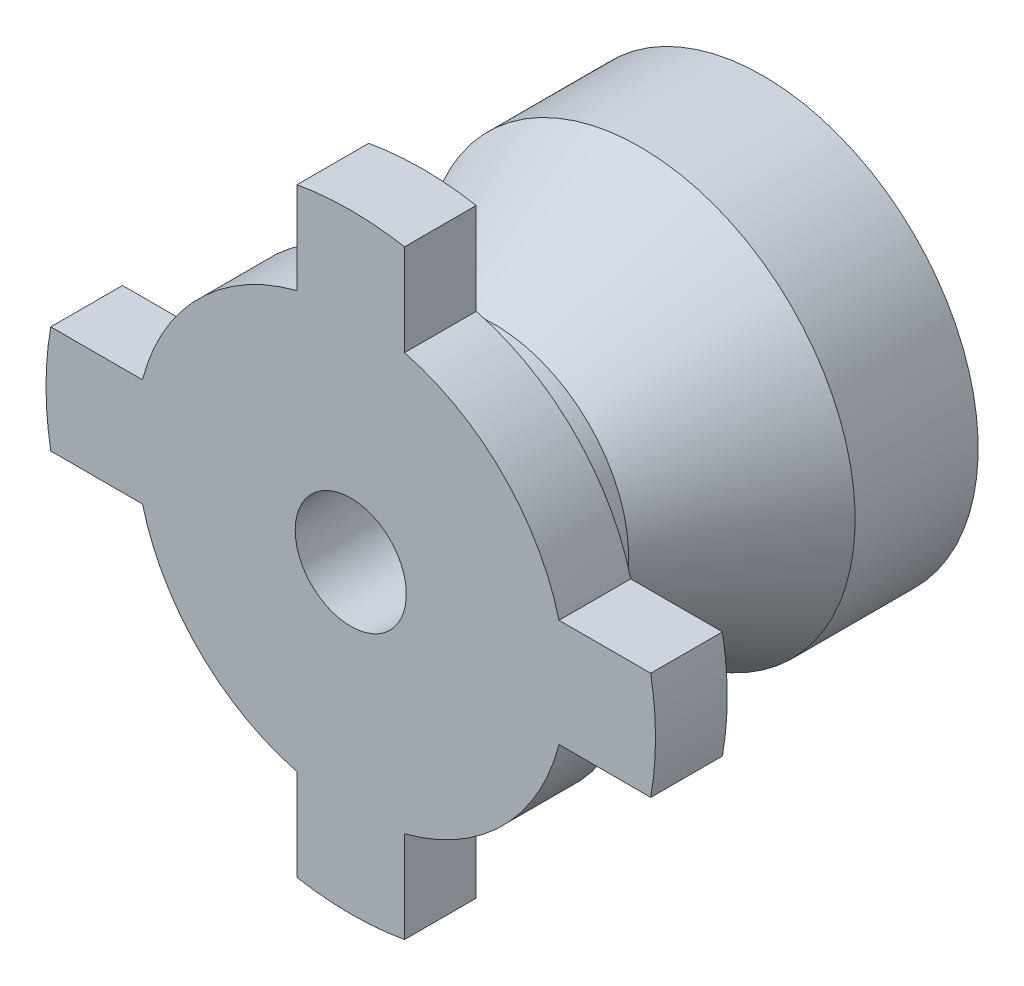
ISO-10303-21;
HEADER;
FILE_DESCRIPTION(('STEP AP214'),'2;1');
FILE_NAME('part.step','',(''),(''),'','','');
FILE_SCHEMA(('AUTOMOTIVE_DESIGN { 1 0 10303 214 1 1 1 1 }'));
ENDSEC;
DATA;
#1=APPLICATION_CONTEXT('core data for automotive mechanical design processes');
#2=APPLICATION_PROTOCOL_DEFINITION('international standard','automotive_design',2000,#1);
#3=PRODUCT_CONTEXT('',#1,'mechanical');
#4=PRODUCT('Part','Part','',(#3));
#5=PRODUCT_RELATED_PRODUCT_CATEGORY('part','',(#4));
#6=PRODUCT_DEFINITION_FORMATION('','',#4);
#7=PRODUCT_DEFINITION_CONTEXT('part definition',#1,'design');
#8=PRODUCT_DEFINITION('design','',#6,#7);
#9=PRODUCT_DEFINITION_SHAPE('','',#8);
#10=(LENGTH_UNIT() NAMED_UNIT(*) SI_UNIT(.MILLI.,.METRE.));
#11=(NAMED_UNIT(*) PLANE_ANGLE_UNIT() SI_UNIT($,.RADIAN.));
#12=(NAMED_UNIT(*) SI_UNIT($,.STERADIAN.) SOLID_ANGLE_UNIT());
#13=UNCERTAINTY_MEASURE_WITH_UNIT(LENGTH_MEASURE(1.E-05),#10,'distance_accuracy_value','');
#14=(GEOMETRIC_REPRESENTATION_CONTEXT(3) GLOBAL_UNCERTAINTY_ASSIGNED_CONTEXT((#13)) GLOBAL_UNIT_ASSIGNED_CONTEXT((#10,
#11,#12)) REPRESENTATION_CONTEXT('',''));
#15=CARTESIAN_POINT('',(0.,0.,0.));
#16=DIRECTION('',(0.,0.,1.));
#17=DIRECTION('',(1.,0.,0.));
#18=AXIS2_PLACEMENT_3D('',#15,#16,#17);
#19=CARTESIAN_POINT('',(0.,0.,-14.2603159562621));
#20=DIRECTION('',(0.,0.,-1.));
#21=DIRECTION('',(-1.,0.,0.));
#22=AXIS2_PLACEMENT_3D('',#19,#20,#21);
#23=CYLINDRICAL_SURFACE('',#22,6.);
#24=DIRECTION('',(0.,0.,1.));
#25=VECTOR('',#24,1.);
#26=CARTESIAN_POINT('',(-5.80947501931113,1.5,-2.));
#27=LINE('',#26,#25);
#28=CARTESIAN_POINT('',(-5.80947501931113,1.5,-2.));
#29=VERTEX_POINT('',#28);
#30=CARTESIAN_POINT('',(-5.80947501931113,1.5,0.));
#31=VERTEX_POINT('',#30);
#32=EDGE_CURVE('E201',#29,#31,#27,.T.);
#33=ORIENTED_EDGE('',*,*,#32,.T.);
#34=CARTESIAN_POINT('',(0.,0.,0.));
#35=DIRECTION('',(0.,0.,-1.));
#36=DIRECTION('',(-1.,0.,0.));
#37=AXIS2_PLACEMENT_3D('',#34,#35,#36);
#38=CIRCLE('',#37,6.);
#39=CARTESIAN_POINT('',(-1.5,5.80947501931113,0.));
#40=VERTEX_POINT('',#39);
#41=EDGE_CURVE('E319',#31,#40,#38,.T.);
#42=ORIENTED_EDGE('',*,*,#41,.T.);
#43=DIRECTION('',(0.,0.,1.));
#44=VECTOR('',#43,1.);
#45=CARTESIAN_POINT('',(-1.5,5.80947501931113,-2.));
#46=LINE('',#45,#44);
#47=CARTESIAN_POINT('',(-1.5,5.80947501931113,-2.));
#48=VERTEX_POINT('',#47);
#49=EDGE_CURVE('E211',#48,#40,#46,.T.);
#50=ORIENTED_EDGE('',*,*,#49,.F.);
#51=CARTESIAN_POINT('',(0.,0.,-2.));
#52=DIRECTION('',(0.,0.,-1.));
#53=DIRECTION('',(-1.,0.,0.));
#54=AXIS2_PLACEMENT_3D('',#51,#52,#53);
#55=CIRCLE('',#54,6.);
#56=EDGE_CURVE('E11',#29,#48,#55,.T.);
#57=ORIENTED_EDGE('',*,*,#56,.F.);
#58=EDGE_LOOP('',(#33,#42,#50,#57));
#59=FACE_BOUND('',#58,.T.);
#60=ADVANCED_FACE('F45',(#59),#23,.T.);
#61=DIRECTION('',(0.,0.,1.));
#62=VECTOR('',#61,1.);
#63=CARTESIAN_POINT('',(1.5,5.80947501931113,-2.));
#64=LINE('',#63,#62);
#65=CARTESIAN_POINT('',(1.5,5.80947501931113,-2.));
#66=VERTEX_POINT('',#65);
#67=CARTESIAN_POINT('',(1.5,5.80947501931113,0.));
#68=VERTEX_POINT('',#67);
#69=EDGE_CURVE('E215',#66,#68,#64,.T.);
#70=ORIENTED_EDGE('',*,*,#69,.T.);
#71=CARTESIAN_POINT('',(5.80947501931113,1.5,0.));
#72=VERTEX_POINT('',#71);
#73=EDGE_CURVE('E323',#68,#72,#38,.T.);
#74=ORIENTED_EDGE('',*,*,#73,.T.);
#75=DIRECTION('',(0.,0.,1.));
#76=VECTOR('',#75,1.);
#77=CARTESIAN_POINT('',(5.80947501931113,1.5,-2.));
#78=LINE('',#77,#76);
#79=CARTESIAN_POINT('',(5.80947501931113,1.5,-2.));
#80=VERTEX_POINT('',#79);
#81=EDGE_CURVE('E249',#80,#72,#78,.T.);
#82=ORIENTED_EDGE('',*,*,#81,.F.);
#83=EDGE_CURVE('E54',#66,#80,#55,.T.);
#84=ORIENTED_EDGE('',*,*,#83,.F.);
#85=EDGE_LOOP('',(#70,#74,#82,#84));
#86=FACE_BOUND('',#85,.T.);
#87=ADVANCED_FACE('F418',(#86),#23,.T.);
#88=DIRECTION('',(0.,0.,1.));
#89=VECTOR('',#88,1.);
#90=CARTESIAN_POINT('',(5.80947501931113,-1.5,-2.));
#91=LINE('',#90,#89);
#92=CARTESIAN_POINT('',(5.80947501931112,-1.5,-2.));
#93=VERTEX_POINT('',#92);
#94=CARTESIAN_POINT('',(5.80947501931113,-1.5,0.));
#95=VERTEX_POINT('',#94);
#96=EDGE_CURVE('E253',#93,#95,#91,.T.);
#97=ORIENTED_EDGE('',*,*,#96,.T.);
#98=CARTESIAN_POINT('',(1.5,-5.80947501931113,0.));
#99=VERTEX_POINT('',#98);
#100=EDGE_CURVE('E389',#95,#99,#38,.T.);
#101=ORIENTED_EDGE('',*,*,#100,.T.);
#102=DIRECTION('',(0.,0.,1.));
#103=VECTOR('',#102,1.);
#104=CARTESIAN_POINT('',(1.5,-5.80947501931113,-2.));
#105=LINE('',#104,#103);
#106=CARTESIAN_POINT('',(1.5,-5.80947501931113,-2.));
#107=VERTEX_POINT('',#106);
#108=EDGE_CURVE('E287',#107,#99,#105,.T.);
#109=ORIENTED_EDGE('',*,*,#108,.F.);
#110=EDGE_CURVE('E364',#93,#107,#55,.T.);
#111=ORIENTED_EDGE('',*,*,#110,.F.);
#112=EDGE_LOOP('',(#97,#101,#109,#111));
#113=FACE_BOUND('',#112,.T.);
#114=ADVANCED_FACE('F388',(#113),#23,.T.);
#115=DIRECTION('',(0.,0.,1.));
#116=VECTOR('',#115,1.);
#117=CARTESIAN_POINT('',(-5.80947501931113,-1.5,-2.));
#118=LINE('',#117,#116);
#119=CARTESIAN_POINT('',(-5.80947501931113,-1.5,-2.));
#120=VERTEX_POINT('',#119);
#121=CARTESIAN_POINT('',(-5.80947501931113,-1.5,0.));
#122=VERTEX_POINT('',#121);
#123=EDGE_CURVE('E62',#120,#122,#118,.T.);
#124=ORIENTED_EDGE('',*,*,#123,.F.);
#125=CARTESIAN_POINT('',(-1.5,-5.80947501931113,-2.));
#126=VERTEX_POINT('',#125);
#127=EDGE_CURVE('E55',#126,#120,#55,.T.);
#128=ORIENTED_EDGE('',*,*,#127,.F.);
#129=DIRECTION('',(0.,0.,1.));
#130=VECTOR('',#129,1.);
#131=CARTESIAN_POINT('',(-1.5,-5.80947501931113,-2.));
#132=LINE('',#131,#130);
#133=CARTESIAN_POINT('',(-1.5,-5.80947501931113,0.));
#134=VERTEX_POINT('',#133);
#135=EDGE_CURVE('E291',#126,#134,#132,.T.);
#136=ORIENTED_EDGE('',*,*,#135,.T.);
#137=EDGE_CURVE('E200',#134,#122,#38,.T.);
#138=ORIENTED_EDGE('',*,*,#137,.T.);
#139=EDGE_LOOP('',(#124,#128,#136,#138));
#140=FACE_BOUND('',#139,.T.);
#141=ADVANCED_FACE('F47',(#140),#23,.T.);
#142=CARTESIAN_POINT('',(-6.,0.,-2.));
#143=DIRECTION('',(0.,0.,-1.));
#144=DIRECTION('',(-1.,0.,0.));
#145=AXIS2_PLACEMENT_3D('',#142,#143,#144);
#146=PLANE('',#145);
#147=ORIENTED_EDGE('',*,*,#56,.T.);
#148=DIRECTION('',(0.,-1.,0.));
#149=VECTOR('',#148,1.);
#150=CARTESIAN_POINT('',(-1.5,8.36660026534076,-2.));
#151=LINE('',#150,#149);
#152=CARTESIAN_POINT('',(-1.5,8.36660026534076,-2.));
#153=VERTEX_POINT('',#152);
#154=EDGE_CURVE('E238',#153,#48,#151,.T.);
#155=ORIENTED_EDGE('',*,*,#154,.F.);
#156=CARTESIAN_POINT('',(0.,0.,-2.));
#157=DIRECTION('',(0.,0.,1.));
#158=DIRECTION('',(1.,0.,0.));
#159=AXIS2_PLACEMENT_3D('',#156,#157,#158);
#160=CIRCLE('',#159,8.5);
#161=CARTESIAN_POINT('',(1.5,8.36660026534076,-2.));
#162=VERTEX_POINT('',#161);
#163=EDGE_CURVE('E228',#162,#153,#160,.T.);
#164=ORIENTED_EDGE('',*,*,#163,.F.);
#165=DIRECTION('',(0.,1.,0.));
#166=VECTOR('',#165,1.);
#167=CARTESIAN_POINT('',(1.5,8.36660026534076,-2.));
#168=LINE('',#167,#166);
#169=EDGE_CURVE('E210',#66,#162,#168,.T.);
#170=ORIENTED_EDGE('',*,*,#169,.F.);
#171=ORIENTED_EDGE('',*,*,#83,.T.);
#172=DIRECTION('',(-1.,0.,0.));
#173=VECTOR('',#172,1.);
#174=CARTESIAN_POINT('',(8.36660026534076,1.5,-2.));
#175=LINE('',#174,#173);
#176=CARTESIAN_POINT('',(8.36660026534076,1.5,-2.));
#177=VERTEX_POINT('',#176);
#178=EDGE_CURVE('E276',#177,#80,#175,.T.);
#179=ORIENTED_EDGE('',*,*,#178,.F.);
#180=CARTESIAN_POINT('',(0.,0.,-2.));
#181=DIRECTION('',(0.,0.,1.));
#182=DIRECTION('',(1.,0.,0.));
#183=AXIS2_PLACEMENT_3D('',#180,#181,#182);
#184=CIRCLE('',#183,8.5);
#185=CARTESIAN_POINT('',(8.36660026534076,-1.5,-2.));
#186=VERTEX_POINT('',#185);
#187=EDGE_CURVE('E266',#186,#177,#184,.T.);
#188=ORIENTED_EDGE('',*,*,#187,.F.);
#189=DIRECTION('',(1.,0.,0.));
#190=VECTOR('',#189,1.);
#191=CARTESIAN_POINT('',(8.36660026534076,-1.5,-2.));
#192=LINE('',#191,#190);
#193=EDGE_CURVE('E248',#93,#186,#192,.T.);
#194=ORIENTED_EDGE('',*,*,#193,.F.);
#195=ORIENTED_EDGE('',*,*,#110,.T.);
#196=DIRECTION('',(0.,1.,0.));
#197=VECTOR('',#196,1.);
#198=CARTESIAN_POINT('',(1.5,-8.36660026534076,-2.));
#199=LINE('',#198,#197);
#200=CARTESIAN_POINT('',(1.5,-8.36660026534076,-2.));
#201=VERTEX_POINT('',#200);
#202=EDGE_CURVE('E312',#201,#107,#199,.T.);
#203=ORIENTED_EDGE('',*,*,#202,.F.);
#204=CARTESIAN_POINT('',(0.,0.,-2.));
#205=DIRECTION('',(0.,0.,1.));
#206=DIRECTION('',(1.,0.,0.));
#207=AXIS2_PLACEMENT_3D('',#204,#205,#206);
#208=CIRCLE('',#207,8.5);
#209=CARTESIAN_POINT('',(-1.5,-8.36660026534076,-2.));
#210=VERTEX_POINT('',#209);
#211=EDGE_CURVE('E302',#210,#201,#208,.T.);
#212=ORIENTED_EDGE('',*,*,#211,.F.);
#213=DIRECTION('',(0.,-1.,0.));
#214=VECTOR('',#213,1.);
#215=CARTESIAN_POINT('',(-1.5,-8.36660026534076,-2.));
#216=LINE('',#215,#214);
#217=EDGE_CURVE('E286',#126,#210,#216,.T.);
#218=ORIENTED_EDGE('',*,*,#217,.F.);
#219=ORIENTED_EDGE('',*,*,#127,.T.);
#220=DIRECTION('',(1.,0.,0.));
#221=VECTOR('',#220,1.);
#222=CARTESIAN_POINT('',(-8.36660026534076,-1.5,-2.));
#223=LINE('',#222,#221);
#224=CARTESIAN_POINT('',(-8.36660026534076,-1.5,-2.));
#225=VERTEX_POINT('',#224);
#226=EDGE_CURVE('E161',#225,#120,#223,.T.);
#227=ORIENTED_EDGE('',*,*,#226,.F.);
#228=CARTESIAN_POINT('',(0.,0.,-2.));
#229=DIRECTION('',(0.,0.,1.));
#230=DIRECTION('',(1.,0.,0.));
#231=AXIS2_PLACEMENT_3D('',#228,#229,#230);
#232=CIRCLE('',#231,8.5);
#233=CARTESIAN_POINT('',(-8.36660026534076,1.5,-2.));
#234=VERTEX_POINT('',#233);
#235=EDGE_CURVE('E176',#234,#225,#232,.T.);
#236=ORIENTED_EDGE('',*,*,#235,.F.);
#237=DIRECTION('',(-1.,0.,0.));
#238=VECTOR('',#237,1.);
#239=CARTESIAN_POINT('',(-8.36660026534076,1.5,-2.));
#240=LINE('',#239,#238);
#241=EDGE_CURVE('E169',#29,#234,#240,.T.);
#242=ORIENTED_EDGE('',*,*,#241,.F.);
#243=EDGE_LOOP('',(#147,#155,#164,#170,#171,#179,#188,#194,#195,#203,#212,#218,#219,#227,#236,#242));
#244=FACE_BOUND('',#243,.T.);
#245=CARTESIAN_POINT('',(0.,0.,-2.));
#246=DIRECTION('',(0.,0.,-1.));
#247=DIRECTION('',(-1.,0.,0.));
#248=AXIS2_PLACEMENT_3D('',#245,#246,#247);
#249=CIRCLE('',#248,3.75);
#250=CARTESIAN_POINT('',(-3.75,0.,-2.));
#251=VERTEX_POINT('',#250);
#252=EDGE_CURVE('E358',#251,#251,#249,.T.);
#253=ORIENTED_EDGE('',*,*,#252,.F.);
#254=EDGE_LOOP('',(#253));
#255=FACE_BOUND('',#254,.T.);
#256=ADVANCED_FACE('F173',(#244,#255),#146,.T.);
#257=CARTESIAN_POINT('',(0.,0.,-14.2603159562621));
#258=DIRECTION('',(0.,0.,-1.));
#259=DIRECTION('',(-1.,0.,0.));
#260=AXIS2_PLACEMENT_3D('',#257,#258,#259);
#261=CYLINDRICAL_SURFACE('',#260,3.75);
#262=ORIENTED_EDGE('',*,*,#252,.T.);
#263=EDGE_LOOP('',(#262));
#264=FACE_BOUND('',#263,.T.);
#265=CARTESIAN_POINT('',(0.,0.,-4.));
#266=DIRECTION('',(0.,0.,-1.));
#267=DIRECTION('',(-1.,0.,0.));
#268=AXIS2_PLACEMENT_3D('',#265,#266,#267);
#269=CIRCLE('',#268,3.75);
#270=CARTESIAN_POINT('',(-3.75,0.,-4.));
#271=VERTEX_POINT('',#270);
#272=EDGE_CURVE('E355',#271,#271,#269,.T.);
#273=ORIENTED_EDGE('',*,*,#272,.F.);
#274=EDGE_LOOP('',(#273));
#275=FACE_BOUND('',#274,.T.);
#276=ADVANCED_FACE('F433',(#264,#275),#261,.T.);
#277=CARTESIAN_POINT('',(0.,0.,-8.06724970437732));
#278=DIRECTION('',(0.,0.,-1.));
#279=DIRECTION('',(-1.,0.,0.));
#280=AXIS2_PLACEMENT_3D('',#277,#278,#279);
#281=CONICAL_SURFACE('',#280,6.,0.50529622703933);
#282=ORIENTED_EDGE('',*,*,#272,.T.);
#283=EDGE_LOOP('',(#282));
#284=FACE_BOUND('',#283,.T.);
#285=CARTESIAN_POINT('',(0.,0.,-8.06724970437732));
#286=DIRECTION('',(0.,0.,-1.));
#287=DIRECTION('',(-1.,0.,0.));
#288=AXIS2_PLACEMENT_3D('',#285,#286,#287);
#289=CIRCLE('',#288,6.);
#290=CARTESIAN_POINT('',(-6.,0.,-8.06724970437732));
#291=VERTEX_POINT('',#290);
#292=EDGE_CURVE('E351',#291,#291,#289,.T.);
#293=ORIENTED_EDGE('',*,*,#292,.F.);
#294=EDGE_LOOP('',(#293));
#295=FACE_BOUND('',#294,.T.);
#296=ADVANCED_FACE('F438',(#284,#295),#281,.T.);
#297=CARTESIAN_POINT('',(0.,0.,-14.2603159562621));
#298=DIRECTION('',(0.,0.,-1.));
#299=DIRECTION('',(-1.,0.,0.));
#300=AXIS2_PLACEMENT_3D('',#297,#298,#299);
#301=CYLINDRICAL_SURFACE('',#300,6.);
#302=ORIENTED_EDGE('',*,*,#292,.T.);
#303=EDGE_LOOP('',(#302));
#304=FACE_BOUND('',#303,.T.);
#305=CARTESIAN_POINT('',(0.,0.,-11.5));
#306=DIRECTION('',(0.,0.,-1.));
#307=DIRECTION('',(-1.,0.,0.));
#308=AXIS2_PLACEMENT_3D('',#305,#306,#307);
#309=CIRCLE('',#308,6.);
#310=CARTESIAN_POINT('',(-6.,0.,-11.5));
#311=VERTEX_POINT('',#310);
#312=EDGE_CURVE('E347',#311,#311,#309,.T.);
#313=ORIENTED_EDGE('',*,*,#312,.F.);
#314=EDGE_LOOP('',(#313));
#315=FACE_BOUND('',#314,.T.);
#316=ADVANCED_FACE('F443',(#304,#315),#301,.T.);
#317=CARTESIAN_POINT('',(-6.,0.,-11.5));
#318=DIRECTION('',(0.,0.,-1.));
#319=DIRECTION('',(-1.,0.,0.));
#320=AXIS2_PLACEMENT_3D('',#317,#318,#319);
#321=PLANE('',#320);
#322=ORIENTED_EDGE('',*,*,#312,.T.);
#323=EDGE_LOOP('',(#322));
#324=FACE_BOUND('',#323,.T.);
#325=CARTESIAN_POINT('',(0.,0.,-11.5));
#326=DIRECTION('',(0.,0.,-1.));
#327=DIRECTION('',(-1.,0.,0.));
#328=AXIS2_PLACEMENT_3D('',#325,#326,#327);
#329=CIRCLE('',#328,5.);
#330=CARTESIAN_POINT('',(-5.,0.,-11.5));
#331=VERTEX_POINT('',#330);
#332=EDGE_CURVE('E343',#331,#331,#329,.T.);
#333=ORIENTED_EDGE('',*,*,#332,.F.);
#334=EDGE_LOOP('',(#333));
#335=FACE_BOUND('',#334,.T.);
#336=ADVANCED_FACE('F447',(#324,#335),#321,.T.);
#337=CARTESIAN_POINT('',(0.,0.,-14.2603159562621));
#338=DIRECTION('',(0.,0.,-1.));
#339=DIRECTION('',(-1.,0.,0.));
#340=AXIS2_PLACEMENT_3D('',#337,#338,#339);
#341=CYLINDRICAL_SURFACE('',#340,5.);
#342=ORIENTED_EDGE('',*,*,#332,.T.);
#343=EDGE_LOOP('',(#342));
#344=FACE_BOUND('',#343,.T.);
#345=CARTESIAN_POINT('',(0.,0.,-9.));
#346=DIRECTION('',(0.,0.,-1.));
#347=DIRECTION('',(-1.,0.,0.));
#348=AXIS2_PLACEMENT_3D('',#345,#346,#347);
#349=CIRCLE('',#348,5.);
#350=CARTESIAN_POINT('',(-5.,0.,-9.));
#351=VERTEX_POINT('',#350);
#352=EDGE_CURVE('E339',#351,#351,#349,.T.);
#353=ORIENTED_EDGE('',*,*,#352,.F.);
#354=EDGE_LOOP('',(#353));
#355=FACE_BOUND('',#354,.T.);
#356=ADVANCED_FACE('F451',(#344,#355),#341,.F.);
#357=CARTESIAN_POINT('',(-5.,0.,-9.));
#358=DIRECTION('',(0.,0.,-1.));
#359=DIRECTION('',(-1.,0.,0.));
#360=AXIS2_PLACEMENT_3D('',#357,#358,#359);
#361=PLANE('',#360);
#362=ORIENTED_EDGE('',*,*,#352,.T.);
#363=EDGE_LOOP('',(#362));
#364=FACE_BOUND('',#363,.T.);
#365=CARTESIAN_POINT('',(0.,0.,-9.));
#366=DIRECTION('',(0.,0.,-1.));
#367=DIRECTION('',(-1.,0.,0.));
#368=AXIS2_PLACEMENT_3D('',#365,#366,#367);
#369=CIRCLE('',#368,2.68835962889717);
#370=CARTESIAN_POINT('',(-2.68835962889717,0.,-9.));
#371=VERTEX_POINT('',#370);
#372=EDGE_CURVE('E335',#371,#371,#369,.T.);
#373=ORIENTED_EDGE('',*,*,#372,.F.);
#374=EDGE_LOOP('',(#373));
#375=FACE_BOUND('',#374,.T.);
#376=ADVANCED_FACE('F455',(#364,#375),#361,.T.);
#377=CARTESIAN_POINT('',(0.,0.,-14.2603159562621));
#378=DIRECTION('',(0.,0.,-1.));
#379=DIRECTION('',(-1.,0.,0.));
#380=AXIS2_PLACEMENT_3D('',#377,#378,#379);
#381=CYLINDRICAL_SURFACE('',#380,2.68835962889717);
#382=ORIENTED_EDGE('',*,*,#372,.T.);
#383=EDGE_LOOP('',(#382));
#384=FACE_BOUND('',#383,.T.);
#385=CARTESIAN_POINT('',(0.,0.,-7.5));
#386=DIRECTION('',(0.,0.,-1.));
#387=DIRECTION('',(-1.,0.,0.));
#388=AXIS2_PLACEMENT_3D('',#385,#386,#387);
#389=CIRCLE('',#388,2.68835962889717);
#390=CARTESIAN_POINT('',(-2.68835962889717,0.,-7.5));
#391=VERTEX_POINT('',#390);
#392=EDGE_CURVE('E331',#391,#391,#389,.T.);
#393=ORIENTED_EDGE('',*,*,#392,.F.);
#394=EDGE_LOOP('',(#393));
#395=FACE_BOUND('',#394,.T.);
#396=ADVANCED_FACE('F459',(#384,#395),#381,.F.);
#397=CARTESIAN_POINT('',(-2.68835962889717,0.,-7.5));
#398=DIRECTION('',(0.,0.,-1.));
#399=DIRECTION('',(-1.,0.,0.));
#400=AXIS2_PLACEMENT_3D('',#397,#398,#399);
#401=PLANE('',#400);
#402=ORIENTED_EDGE('',*,*,#392,.T.);
#403=EDGE_LOOP('',(#402));
#404=FACE_BOUND('',#403,.T.);
#405=CARTESIAN_POINT('',(0.,0.,-7.5));
#406=DIRECTION('',(0.,0.,-1.));
#407=DIRECTION('',(-1.,0.,0.));
#408=AXIS2_PLACEMENT_3D('',#405,#406,#407);
#409=CIRCLE('',#408,1.55);
#410=CARTESIAN_POINT('',(-1.55,0.,-7.5));
#411=VERTEX_POINT('',#410);
#412=EDGE_CURVE('E327',#411,#411,#409,.T.);
#413=ORIENTED_EDGE('',*,*,#412,.F.);
#414=EDGE_LOOP('',(#413));
#415=FACE_BOUND('',#414,.T.);
#416=ADVANCED_FACE('F463',(#404,#415),#401,.T.);
#417=CARTESIAN_POINT('',(0.,0.,-14.2603159562621));
#418=DIRECTION('',(0.,0.,-1.));
#419=DIRECTION('',(-1.,0.,0.));
#420=AXIS2_PLACEMENT_3D('',#417,#418,#419);
#421=CYLINDRICAL_SURFACE('',#420,1.55);
#422=ORIENTED_EDGE('',*,*,#412,.T.);
#423=EDGE_LOOP('',(#422));
#424=FACE_BOUND('',#423,.T.);
#425=CARTESIAN_POINT('',(0.,0.,0.));
#426=DIRECTION('',(0.,0.,-1.));
#427=DIRECTION('',(-1.,0.,0.));
#428=AXIS2_PLACEMENT_3D('',#425,#426,#427);
#429=CIRCLE('',#428,1.55);
#430=CARTESIAN_POINT('',(-1.55,0.,0.));
#431=VERTEX_POINT('',#430);
#432=EDGE_CURVE('E322',#431,#431,#429,.T.);
#433=ORIENTED_EDGE('',*,*,#432,.F.);
#434=EDGE_LOOP('',(#433));
#435=FACE_BOUND('',#434,.T.);
#436=ADVANCED_FACE('F467',(#424,#435),#421,.F.);
#437=CARTESIAN_POINT('',(-1.55,0.,0.));
#438=DIRECTION('',(0.,0.,1.));
#439=DIRECTION('',(1.,0.,0.));
#440=AXIS2_PLACEMENT_3D('',#437,#438,#439);
#441=PLANE('',#440);
#442=ORIENTED_EDGE('',*,*,#432,.T.);
#443=EDGE_LOOP('',(#442));
#444=FACE_BOUND('',#443,.T.);
#445=ORIENTED_EDGE('',*,*,#41,.F.);
#446=DIRECTION('',(-1.,0.,0.));
#447=VECTOR('',#446,1.);
#448=CARTESIAN_POINT('',(-8.36660026534076,1.5,0.));
#449=LINE('',#448,#447);
#450=CARTESIAN_POINT('',(-8.36660026534076,1.5,0.));
#451=VERTEX_POINT('',#450);
#452=EDGE_CURVE('E184',#31,#451,#449,.T.);
#453=ORIENTED_EDGE('',*,*,#452,.T.);
#454=CARTESIAN_POINT('',(0.,0.,0.));
#455=DIRECTION('',(0.,0.,1.));
#456=DIRECTION('',(1.,0.,0.));
#457=AXIS2_PLACEMENT_3D('',#454,#455,#456);
#458=CIRCLE('',#457,8.5);
#459=CARTESIAN_POINT('',(-8.36660026534076,-1.5,0.));
#460=VERTEX_POINT('',#459);
#461=EDGE_CURVE('E192',#451,#460,#458,.T.);
#462=ORIENTED_EDGE('',*,*,#461,.T.);
#463=DIRECTION('',(1.,0.,0.));
#464=VECTOR('',#463,1.);
#465=CARTESIAN_POINT('',(-8.36660026534076,-1.5,0.));
#466=LINE('',#465,#464);
#467=EDGE_CURVE('E163',#460,#122,#466,.T.);
#468=ORIENTED_EDGE('',*,*,#467,.T.);
#469=ORIENTED_EDGE('',*,*,#137,.F.);
#470=DIRECTION('',(0.,-1.,0.));
#471=VECTOR('',#470,1.);
#472=CARTESIAN_POINT('',(-1.5,-8.36660026534076,0.));
#473=LINE('',#472,#471);
#474=CARTESIAN_POINT('',(-1.5,-8.36660026534076,0.));
#475=VERTEX_POINT('',#474);
#476=EDGE_CURVE('E297',#134,#475,#473,.T.);
#477=ORIENTED_EDGE('',*,*,#476,.T.);
#478=CARTESIAN_POINT('',(0.,0.,0.));
#479=DIRECTION('',(0.,0.,1.));
#480=DIRECTION('',(1.,0.,0.));
#481=AXIS2_PLACEMENT_3D('',#478,#479,#480);
#482=CIRCLE('',#481,8.5);
#483=CARTESIAN_POINT('',(1.5,-8.36660026534076,0.));
#484=VERTEX_POINT('',#483);
#485=EDGE_CURVE('E260',#475,#484,#482,.T.);
#486=ORIENTED_EDGE('',*,*,#485,.T.);
#487=DIRECTION('',(0.,1.,0.));
#488=VECTOR('',#487,1.);
#489=CARTESIAN_POINT('',(1.5,-8.36660026534076,0.));
#490=LINE('',#489,#488);
#491=EDGE_CURVE('E301',#484,#99,#490,.T.);
#492=ORIENTED_EDGE('',*,*,#491,.T.);
#493=ORIENTED_EDGE('',*,*,#100,.F.);
#494=DIRECTION('',(1.,0.,0.));
#495=VECTOR('',#494,1.);
#496=CARTESIAN_POINT('',(8.36660026534076,-1.5,0.));
#497=LINE('',#496,#495);
#498=CARTESIAN_POINT('',(8.36660026534076,-1.5,0.));
#499=VERTEX_POINT('',#498);
#500=EDGE_CURVE('E261',#95,#499,#497,.T.);
#501=ORIENTED_EDGE('',*,*,#500,.T.);
#502=CARTESIAN_POINT('',(0.,0.,0.));
#503=DIRECTION('',(0.,0.,1.));
#504=DIRECTION('',(1.,0.,0.));
#505=AXIS2_PLACEMENT_3D('',#502,#503,#504);
#506=CIRCLE('',#505,8.5);
#507=CARTESIAN_POINT('',(8.36660026534076,1.5,0.));
#508=VERTEX_POINT('',#507);
#509=EDGE_CURVE('E222',#499,#508,#506,.T.);
#510=ORIENTED_EDGE('',*,*,#509,.T.);
#511=DIRECTION('',(-1.,0.,0.));
#512=VECTOR('',#511,1.);
#513=CARTESIAN_POINT('',(8.36660026534076,1.5,0.));
#514=LINE('',#513,#512);
#515=EDGE_CURVE('E265',#508,#72,#514,.T.);
#516=ORIENTED_EDGE('',*,*,#515,.T.);
#517=ORIENTED_EDGE('',*,*,#73,.F.);
#518=DIRECTION('',(0.,1.,0.));
#519=VECTOR('',#518,1.);
#520=CARTESIAN_POINT('',(1.5,8.36660026534076,0.));
#521=LINE('',#520,#519);
#522=CARTESIAN_POINT('',(1.5,8.36660026534076,0.));
#523=VERTEX_POINT('',#522);
#524=EDGE_CURVE('E223',#68,#523,#521,.T.);
#525=ORIENTED_EDGE('',*,*,#524,.T.);
#526=CARTESIAN_POINT('',(0.,0.,0.));
#527=DIRECTION('',(0.,0.,1.));
#528=DIRECTION('',(1.,0.,0.));
#529=AXIS2_PLACEMENT_3D('',#526,#527,#528);
#530=CIRCLE('',#529,8.5);
#531=CARTESIAN_POINT('',(-1.5,8.36660026534076,0.));
#532=VERTEX_POINT('',#531);
#533=EDGE_CURVE('E195',#523,#532,#530,.T.);
#534=ORIENTED_EDGE('',*,*,#533,.T.);
#535=DIRECTION('',(0.,-1.,0.));
#536=VECTOR('',#535,1.);
#537=CARTESIAN_POINT('',(-1.5,8.36660026534076,0.));
#538=LINE('',#537,#536);
#539=EDGE_CURVE('E227',#532,#40,#538,.T.);
#540=ORIENTED_EDGE('',*,*,#539,.T.);
#541=EDGE_LOOP('',(#445,#453,#462,#468,#469,#477,#486,#492,#493,#501,#510,#516,#517,#525,#534,#540));
#542=FACE_BOUND('',#541,.T.);
#543=ADVANCED_FACE('F394',(#444,#542),#441,.T.);
#544=CARTESIAN_POINT('',(0.,0.,-2.));
#545=DIRECTION('',(0.,0.,1.));
#546=DIRECTION('',(1.,0.,0.));
#547=AXIS2_PLACEMENT_3D('',#544,#545,#546);
#548=CYLINDRICAL_SURFACE('',#547,8.5);
#549=ORIENTED_EDGE('',*,*,#485,.F.);
#550=DIRECTION('',(0.,0.,1.));
#551=VECTOR('',#550,1.);
#552=CARTESIAN_POINT('',(-1.5,-8.36660026534076,-2.));
#553=LINE('',#552,#551);
#554=EDGE_CURVE('E294',#210,#475,#553,.T.);
#555=ORIENTED_EDGE('',*,*,#554,.F.);
#556=ORIENTED_EDGE('',*,*,#211,.T.);
#557=DIRECTION('',(0.,0.,1.));
#558=VECTOR('',#557,1.);
#559=CARTESIAN_POINT('',(1.5,-8.36660026534076,-2.));
#560=LINE('',#559,#558);
#561=EDGE_CURVE('E283',#201,#484,#560,.T.);
#562=ORIENTED_EDGE('',*,*,#561,.T.);
#563=EDGE_LOOP('',(#549,#555,#556,#562));
#564=FACE_BOUND('',#563,.T.);
#565=ADVANCED_FACE('F398',(#564),#548,.T.);
#566=CARTESIAN_POINT('',(-1.5,-8.36660026534076,-2.));
#567=DIRECTION('',(-1.,0.,0.));
#568=DIRECTION('',(0.,-1.,0.));
#569=AXIS2_PLACEMENT_3D('',#566,#567,#568);
#570=PLANE('',#569);
#571=ORIENTED_EDGE('',*,*,#476,.F.);
#572=ORIENTED_EDGE('',*,*,#135,.F.);
#573=ORIENTED_EDGE('',*,*,#217,.T.);
#574=ORIENTED_EDGE('',*,*,#554,.T.);
#575=EDGE_LOOP('',(#571,#572,#573,#574));
#576=FACE_BOUND('',#575,.T.);
#577=ADVANCED_FACE('F401',(#576),#570,.T.);
#578=CARTESIAN_POINT('',(1.5,-8.36660026534076,-2.));
#579=DIRECTION('',(1.,0.,0.));
#580=DIRECTION('',(0.,1.,0.));
#581=AXIS2_PLACEMENT_3D('',#578,#579,#580);
#582=PLANE('',#581);
#583=ORIENTED_EDGE('',*,*,#491,.F.);
#584=ORIENTED_EDGE('',*,*,#561,.F.);
#585=ORIENTED_EDGE('',*,*,#202,.T.);
#586=ORIENTED_EDGE('',*,*,#108,.T.);
#587=EDGE_LOOP('',(#583,#584,#585,#586));
#588=FACE_BOUND('',#587,.T.);
#589=ADVANCED_FACE('F392',(#588),#582,.T.);
#590=CARTESIAN_POINT('',(0.,0.,-2.));
#591=DIRECTION('',(0.,0.,1.));
#592=DIRECTION('',(1.,0.,0.));
#593=AXIS2_PLACEMENT_3D('',#590,#591,#592);
#594=CYLINDRICAL_SURFACE('',#593,8.5);
#595=ORIENTED_EDGE('',*,*,#509,.F.);
#596=DIRECTION('',(0.,0.,1.));
#597=VECTOR('',#596,1.);
#598=CARTESIAN_POINT('',(8.36660026534076,-1.5,-2.));
#599=LINE('',#598,#597);
#600=EDGE_CURVE('E257',#186,#499,#599,.T.);
#601=ORIENTED_EDGE('',*,*,#600,.F.);
#602=ORIENTED_EDGE('',*,*,#187,.T.);
#603=DIRECTION('',(0.,0.,1.));
#604=VECTOR('',#603,1.);
#605=CARTESIAN_POINT('',(8.36660026534076,1.5,-2.));
#606=LINE('',#605,#604);
#607=EDGE_CURVE('E245',#177,#508,#606,.T.);
#608=ORIENTED_EDGE('',*,*,#607,.T.);
#609=EDGE_LOOP('',(#595,#601,#602,#608));
#610=FACE_BOUND('',#609,.T.);
#611=ADVANCED_FACE('F382',(#610),#594,.T.);
#612=CARTESIAN_POINT('',(8.36660026534076,-1.5,-2.));
#613=DIRECTION('',(0.,-1.,0.));
#614=DIRECTION('',(1.,0.,0.));
#615=AXIS2_PLACEMENT_3D('',#612,#613,#614);
#616=PLANE('',#615);
#617=ORIENTED_EDGE('',*,*,#500,.F.);
#618=ORIENTED_EDGE('',*,*,#96,.F.);
#619=ORIENTED_EDGE('',*,*,#193,.T.);
#620=ORIENTED_EDGE('',*,*,#600,.T.);
#621=EDGE_LOOP('',(#617,#618,#619,#620));
#622=FACE_BOUND('',#621,.T.);
#623=ADVANCED_FACE('F386',(#622),#616,.T.);
#624=CARTESIAN_POINT('',(8.36660026534076,1.5,-2.));
#625=DIRECTION('',(0.,1.,0.));
#626=DIRECTION('',(-1.,0.,0.));
#627=AXIS2_PLACEMENT_3D('',#624,#625,#626);
#628=PLANE('',#627);
#629=ORIENTED_EDGE('',*,*,#515,.F.);
#630=ORIENTED_EDGE('',*,*,#607,.F.);
#631=ORIENTED_EDGE('',*,*,#178,.T.);
#632=ORIENTED_EDGE('',*,*,#81,.T.);
#633=EDGE_LOOP('',(#629,#630,#631,#632));
#634=FACE_BOUND('',#633,.T.);
#635=ADVANCED_FACE('F379',(#634),#628,.T.);
#636=CARTESIAN_POINT('',(0.,0.,-2.));
#637=DIRECTION('',(0.,0.,1.));
#638=DIRECTION('',(1.,0.,0.));
#639=AXIS2_PLACEMENT_3D('',#636,#637,#638);
#640=CYLINDRICAL_SURFACE('',#639,8.5);
#641=ORIENTED_EDGE('',*,*,#533,.F.);
#642=DIRECTION('',(0.,0.,1.));
#643=VECTOR('',#642,1.);
#644=CARTESIAN_POINT('',(1.5,8.36660026534076,-2.));
#645=LINE('',#644,#643);
#646=EDGE_CURVE('E219',#162,#523,#645,.T.);
#647=ORIENTED_EDGE('',*,*,#646,.F.);
#648=ORIENTED_EDGE('',*,*,#163,.T.);
#649=DIRECTION('',(0.,0.,1.));
#650=VECTOR('',#649,1.);
#651=CARTESIAN_POINT('',(-1.5,8.36660026534076,-2.));
#652=LINE('',#651,#650);
#653=EDGE_CURVE('E207',#153,#532,#652,.T.);
#654=ORIENTED_EDGE('',*,*,#653,.T.);
#655=EDGE_LOOP('',(#641,#647,#648,#654));
#656=FACE_BOUND('',#655,.T.);
#657=ADVANCED_FACE('F414',(#656),#640,.T.);
#658=CARTESIAN_POINT('',(1.5,8.36660026534076,-2.));
#659=DIRECTION('',(1.,0.,0.));
#660=DIRECTION('',(0.,0.,-1.));
#661=AXIS2_PLACEMENT_3D('',#658,#659,#660);
#662=PLANE('',#661);
#663=ORIENTED_EDGE('',*,*,#524,.F.);
#664=ORIENTED_EDGE('',*,*,#69,.F.);
#665=ORIENTED_EDGE('',*,*,#169,.T.);
#666=ORIENTED_EDGE('',*,*,#646,.T.);
#667=EDGE_LOOP('',(#663,#664,#665,#666));
#668=FACE_BOUND('',#667,.T.);
#669=ADVANCED_FACE('F417',(#668),#662,.T.);
#670=CARTESIAN_POINT('',(-1.5,8.36660026534076,-2.));
#671=DIRECTION('',(-1.,0.,0.));
#672=DIRECTION('',(0.,0.,1.));
#673=AXIS2_PLACEMENT_3D('',#670,#671,#672);
#674=PLANE('',#673);
#675=ORIENTED_EDGE('',*,*,#539,.F.);
#676=ORIENTED_EDGE('',*,*,#653,.F.);
#677=ORIENTED_EDGE('',*,*,#154,.T.);
#678=ORIENTED_EDGE('',*,*,#49,.T.);
#679=EDGE_LOOP('',(#675,#676,#677,#678));
#680=FACE_BOUND('',#679,.T.);
#681=ADVANCED_FACE('F411',(#680),#674,.T.);
#682=CARTESIAN_POINT('',(0.,0.,-2.));
#683=DIRECTION('',(0.,0.,1.));
#684=DIRECTION('',(1.,0.,0.));
#685=AXIS2_PLACEMENT_3D('',#682,#683,#684);
#686=CYLINDRICAL_SURFACE('',#685,8.5);
#687=ORIENTED_EDGE('',*,*,#461,.F.);
#688=DIRECTION('',(0.,0.,1.));
#689=VECTOR('',#688,1.);
#690=CARTESIAN_POINT('',(-8.36660026534076,1.5,-2.));
#691=LINE('',#690,#689);
#692=EDGE_CURVE('E182',#234,#451,#691,.T.);
#693=ORIENTED_EDGE('',*,*,#692,.F.);
#694=ORIENTED_EDGE('',*,*,#235,.T.);
#695=DIRECTION('',(0.,0.,1.));
#696=VECTOR('',#695,1.);
#697=CARTESIAN_POINT('',(-8.36660026534076,-1.5,-2.));
#698=LINE('',#697,#696);
#699=EDGE_CURVE('E158',#225,#460,#698,.T.);
#700=ORIENTED_EDGE('',*,*,#699,.T.);
#701=EDGE_LOOP('',(#687,#693,#694,#700));
#702=FACE_BOUND('',#701,.T.);
#703=ADVANCED_FACE('F181',(#702),#686,.T.);
#704=CARTESIAN_POINT('',(-8.36660026534076,1.5,-2.));
#705=DIRECTION('',(0.,1.,0.));
#706=DIRECTION('',(0.,0.,1.));
#707=AXIS2_PLACEMENT_3D('',#704,#705,#706);
#708=PLANE('',#707);
#709=ORIENTED_EDGE('',*,*,#452,.F.);
#710=ORIENTED_EDGE('',*,*,#32,.F.);
#711=ORIENTED_EDGE('',*,*,#241,.T.);
#712=ORIENTED_EDGE('',*,*,#692,.T.);
#713=EDGE_LOOP('',(#709,#710,#711,#712));
#714=FACE_BOUND('',#713,.T.);
#715=ADVANCED_FACE('F406',(#714),#708,.T.);
#716=CARTESIAN_POINT('',(-8.36660026534076,-1.5,-2.));
#717=DIRECTION('',(0.,-1.,0.));
#718=DIRECTION('',(0.,0.,-1.));
#719=AXIS2_PLACEMENT_3D('',#716,#717,#718);
#720=PLANE('',#719);
#721=ORIENTED_EDGE('',*,*,#467,.F.);
#722=ORIENTED_EDGE('',*,*,#699,.F.);
#723=ORIENTED_EDGE('',*,*,#226,.T.);
#724=ORIENTED_EDGE('',*,*,#123,.T.);
#725=EDGE_LOOP('',(#721,#722,#723,#724));
#726=FACE_BOUND('',#725,.T.);
#727=ADVANCED_FACE('F160',(#726),#720,.T.);
#728=CLOSED_SHELL('',(#60,#87,#114,#141,#256,#276,#296,#316,#336,#356,#376,#396,#416,#436,#543,
#565,#577,#589,#611,#623,#635,#657,#669,#681,#703,#715,#727));
#729=MANIFOLD_SOLID_BREP('B2',#728);
#730=ADVANCED_BREP_SHAPE_REPRESENTATION('',(#18,#729),#14);
#731=SHAPE_DEFINITION_REPRESENTATION(#9,#730);
ENDSEC;
END-ISO-10303-21;
